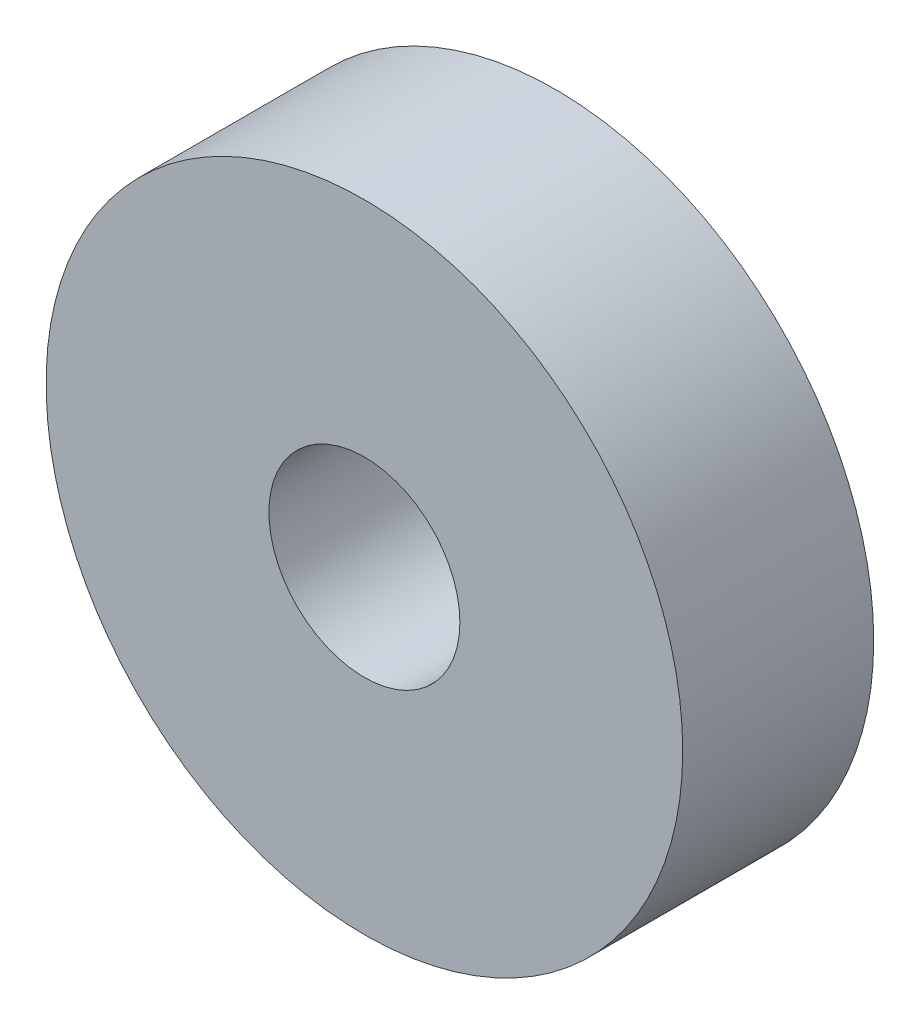
ISO-10303-21;
HEADER;
FILE_DESCRIPTION(('STEP AP214'),'2;1');
FILE_NAME('part.step','',(''),(''),'','','');
FILE_SCHEMA(('AUTOMOTIVE_DESIGN { 1 0 10303 214 1 1 1 1 }'));
ENDSEC;
DATA;
#1=APPLICATION_CONTEXT('core data for automotive mechanical design processes');
#2=APPLICATION_PROTOCOL_DEFINITION('international standard','automotive_design',2000,#1);
#3=PRODUCT_CONTEXT('',#1,'mechanical');
#4=PRODUCT('Part','Part','',(#3));
#5=PRODUCT_RELATED_PRODUCT_CATEGORY('part','',(#4));
#6=PRODUCT_DEFINITION_FORMATION('','',#4);
#7=PRODUCT_DEFINITION_CONTEXT('part definition',#1,'design');
#8=PRODUCT_DEFINITION('design','',#6,#7);
#9=PRODUCT_DEFINITION_SHAPE('','',#8);
#10=(LENGTH_UNIT() NAMED_UNIT(*) SI_UNIT(.MILLI.,.METRE.));
#11=(NAMED_UNIT(*) PLANE_ANGLE_UNIT() SI_UNIT($,.RADIAN.));
#12=(NAMED_UNIT(*) SI_UNIT($,.STERADIAN.) SOLID_ANGLE_UNIT());
#13=UNCERTAINTY_MEASURE_WITH_UNIT(LENGTH_MEASURE(1.E-05),#10,'distance_accuracy_value','');
#14=(GEOMETRIC_REPRESENTATION_CONTEXT(3) GLOBAL_UNCERTAINTY_ASSIGNED_CONTEXT((#13)) GLOBAL_UNIT_ASSIGNED_CONTEXT((#10,
#11,#12)) REPRESENTATION_CONTEXT('',''));
#15=CARTESIAN_POINT('',(0.,0.,0.));
#16=DIRECTION('',(0.,0.,1.));
#17=DIRECTION('',(1.,0.,0.));
#18=AXIS2_PLACEMENT_3D('',#15,#16,#17);
#19=CARTESIAN_POINT('',(8.93120842856115,26.4578481616084,3.));
#20=DIRECTION('',(0.,0.,1.));
#21=DIRECTION('',(1.,0.,0.));
#22=AXIS2_PLACEMENT_3D('',#19,#20,#21);
#23=PLANE('',#22);
#24=CARTESIAN_POINT('',(8.93120842856115,26.4578481616084,3.));
#25=DIRECTION('',(0.,0.,1.));
#26=DIRECTION('',(1.,0.,0.));
#27=AXIS2_PLACEMENT_3D('',#24,#25,#26);
#28=CIRCLE('',#27,5.);
#29=CARTESIAN_POINT('',(13.9312084285612,26.4578481616084,3.));
#30=VERTEX_POINT('',#29);
#31=EDGE_CURVE('E10',#30,#30,#28,.T.);
#32=ORIENTED_EDGE('',*,*,#31,.T.);
#33=EDGE_LOOP('',(#32));
#34=FACE_BOUND('',#33,.T.);
#35=CARTESIAN_POINT('',(8.93120842856115,26.4578481616084,3.));
#36=DIRECTION('',(0.,0.,1.));
#37=DIRECTION('',(1.,0.,0.));
#38=AXIS2_PLACEMENT_3D('',#35,#36,#37);
#39=CIRCLE('',#38,1.5);
#40=CARTESIAN_POINT('',(10.4312084285612,26.4578481616084,3.));
#41=VERTEX_POINT('',#40);
#42=EDGE_CURVE('E48',#41,#41,#39,.T.);
#43=ORIENTED_EDGE('',*,*,#42,.F.);
#44=EDGE_LOOP('',(#43));
#45=FACE_BOUND('',#44,.T.);
#46=ADVANCED_FACE('F37',(#34,#45),#23,.T.);
#47=CARTESIAN_POINT('',(8.93120842856115,26.4578481616084,0.));
#48=DIRECTION('',(0.,0.,1.));
#49=DIRECTION('',(1.,0.,0.));
#50=AXIS2_PLACEMENT_3D('',#47,#48,#49);
#51=PLANE('',#50);
#52=CARTESIAN_POINT('',(8.93120842856115,26.4578481616084,0.));
#53=DIRECTION('',(0.,0.,1.));
#54=DIRECTION('',(1.,0.,0.));
#55=AXIS2_PLACEMENT_3D('',#52,#53,#54);
#56=CIRCLE('',#55,5.);
#57=CARTESIAN_POINT('',(13.9312084285612,26.4578481616084,0.));
#58=VERTEX_POINT('',#57);
#59=EDGE_CURVE('E41',#58,#58,#56,.T.);
#60=ORIENTED_EDGE('',*,*,#59,.F.);
#61=EDGE_LOOP('',(#60));
#62=FACE_BOUND('',#61,.T.);
#63=CARTESIAN_POINT('',(8.93120842856115,26.4578481616084,0.));
#64=DIRECTION('',(0.,0.,1.));
#65=DIRECTION('',(1.,0.,0.));
#66=AXIS2_PLACEMENT_3D('',#63,#64,#65);
#67=CIRCLE('',#66,1.5);
#68=CARTESIAN_POINT('',(10.4312084285612,26.4578481616084,0.));
#69=VERTEX_POINT('',#68);
#70=EDGE_CURVE('E50',#69,#69,#67,.T.);
#71=ORIENTED_EDGE('',*,*,#70,.T.);
#72=EDGE_LOOP('',(#71));
#73=FACE_BOUND('',#72,.T.);
#74=ADVANCED_FACE('F60',(#62,#73),#51,.F.);
#75=CARTESIAN_POINT('',(8.93120842856115,26.4578481616084,3.));
#76=DIRECTION('',(0.,0.,-1.));
#77=DIRECTION('',(-1.,0.,0.));
#78=AXIS2_PLACEMENT_3D('',#75,#76,#77);
#79=CYLINDRICAL_SURFACE('',#78,5.);
#80=ORIENTED_EDGE('',*,*,#31,.F.);
#81=EDGE_LOOP('',(#80));
#82=FACE_BOUND('',#81,.T.);
#83=ORIENTED_EDGE('',*,*,#59,.T.);
#84=EDGE_LOOP('',(#83));
#85=FACE_BOUND('',#84,.T.);
#86=ADVANCED_FACE('F39',(#82,#85),#79,.T.);
#87=CARTESIAN_POINT('',(8.93120842856115,26.4578481616084,3.));
#88=DIRECTION('',(0.,0.,-1.));
#89=DIRECTION('',(-1.,0.,0.));
#90=AXIS2_PLACEMENT_3D('',#87,#88,#89);
#91=CYLINDRICAL_SURFACE('',#90,1.5);
#92=ORIENTED_EDGE('',*,*,#42,.T.);
#93=EDGE_LOOP('',(#92));
#94=FACE_BOUND('',#93,.T.);
#95=ORIENTED_EDGE('',*,*,#70,.F.);
#96=EDGE_LOOP('',(#95));
#97=FACE_BOUND('',#96,.T.);
#98=ADVANCED_FACE('F56',(#94,#97),#91,.F.);
#99=CLOSED_SHELL('',(#46,#74,#86,#98));
#100=MANIFOLD_SOLID_BREP('B2',#99);
#101=ADVANCED_BREP_SHAPE_REPRESENTATION('',(#18,#100),#14);
#102=SHAPE_DEFINITION_REPRESENTATION(#9,#101);
ENDSEC;
END-ISO-10303-21;
